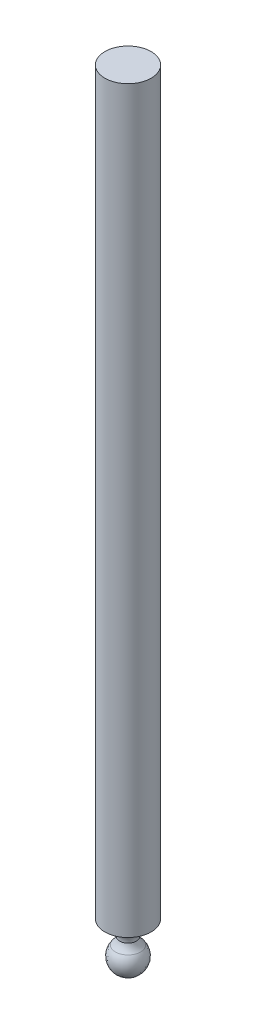
ISO-10303-21;
HEADER;
FILE_DESCRIPTION(('STEP AP214'),'2;1');
FILE_NAME('part.step','',(''),(''),'','','');
FILE_SCHEMA(('AUTOMOTIVE_DESIGN { 1 0 10303 214 1 1 1 1 }'));
ENDSEC;
DATA;
#1=APPLICATION_CONTEXT('core data for automotive mechanical design processes');
#2=APPLICATION_PROTOCOL_DEFINITION('international standard','automotive_design',2000,#1);
#3=PRODUCT_CONTEXT('',#1,'mechanical');
#4=PRODUCT('Part','Part','',(#3));
#5=PRODUCT_RELATED_PRODUCT_CATEGORY('part','',(#4));
#6=PRODUCT_DEFINITION_FORMATION('','',#4);
#7=PRODUCT_DEFINITION_CONTEXT('part definition',#1,'design');
#8=PRODUCT_DEFINITION('design','',#6,#7);
#9=PRODUCT_DEFINITION_SHAPE('','',#8);
#10=(LENGTH_UNIT() NAMED_UNIT(*) SI_UNIT(.MILLI.,.METRE.));
#11=(NAMED_UNIT(*) PLANE_ANGLE_UNIT() SI_UNIT($,.RADIAN.));
#12=(NAMED_UNIT(*) SI_UNIT($,.STERADIAN.) SOLID_ANGLE_UNIT());
#13=UNCERTAINTY_MEASURE_WITH_UNIT(LENGTH_MEASURE(1.E-05),#10,'distance_accuracy_value','');
#14=(GEOMETRIC_REPRESENTATION_CONTEXT(3) GLOBAL_UNCERTAINTY_ASSIGNED_CONTEXT((#13)) GLOBAL_UNIT_ASSIGNED_CONTEXT((#10,
#11,#12)) REPRESENTATION_CONTEXT('',''));
#15=CARTESIAN_POINT('',(0.,0.,0.));
#16=DIRECTION('',(0.,0.,1.));
#17=DIRECTION('',(1.,0.,0.));
#18=AXIS2_PLACEMENT_3D('',#15,#16,#17);
#19=CARTESIAN_POINT('',(0.,-10.4492978523732,0.155031718212298));
#20=DIRECTION('',(-1.,0.,0.));
#21=DIRECTION('',(0.,0.,1.));
#22=AXIS2_PLACEMENT_3D('',#19,#20,#21);
#23=CIRCLE('',#22,5.);
#24=TRIMMED_CURVE('',#23,(PARAMETER_VALUE(-1.60180764080338)),
(PARAMETER_VALUE(1.60180764080338)),.T.,.PARAMETER.);
#25=CARTESIAN_POINT('',(0.,-10.4492978523732,0.));
#26=DIRECTION('',(0.,1.,0.));
#27=AXIS1_PLACEMENT('',#25,#26);
#28=SURFACE_OF_REVOLUTION('',#24,#27);
#29=CARTESIAN_POINT('',(0.,-15.4468937910569,0.));
#30=VERTEX_POINT('',#29);
#31=VERTEX_LOOP('',#30);
#32=FACE_BOUND('',#31,.T.);
#33=CARTESIAN_POINT('',(0.,-7.32791100208723,0.));
#34=DIRECTION('',(0.,1.,0.));
#35=DIRECTION('',(0.,0.,1.));
#36=AXIS2_PLACEMENT_3D('',#33,#34,#35);
#37=CIRCLE('',#36,4.06104555982397);
#38=CARTESIAN_POINT('',(0.,-7.32791100208723,4.06104555982397));
#39=VERTEX_POINT('',#38);
#40=EDGE_CURVE('E11',#39,#39,#37,.T.);
#41=ORIENTED_EDGE('',*,*,#40,.F.);
#42=EDGE_LOOP('',(#41));
#43=FACE_BOUND('',#42,.T.);
#44=ADVANCED_FACE('F34',(#32,#43),#28,.T.);
#45=CARTESIAN_POINT('',(0.,-3.69137278801575,0.));
#46=DIRECTION('',(0.,1.,0.));
#47=DIRECTION('',(0.,0.,1.));
#48=AXIS2_PLACEMENT_3D('',#45,#46,#47);
#49=TOROIDAL_SURFACE('',#48,7.58438820420573,5.06343298288041);
#50=ORIENTED_EDGE('',*,*,#40,.T.);
#51=EDGE_LOOP('',(#50));
#52=FACE_BOUND('',#51,.T.);
#53=CARTESIAN_POINT('',(0.,-4.98636052247416,0.));
#54=DIRECTION('',(0.,1.,0.));
#55=DIRECTION('',(0.,0.,1.));
#56=AXIS2_PLACEMENT_3D('',#53,#54,#55);
#57=CIRCLE('',#56,2.6893539510341);
#58=CARTESIAN_POINT('',(0.,-4.98636052247416,2.6893539510341));
#59=VERTEX_POINT('',#58);
#60=EDGE_CURVE('E40',#59,#59,#57,.T.);
#61=ORIENTED_EDGE('',*,*,#60,.F.);
#62=EDGE_LOOP('',(#61));
#63=FACE_BOUND('',#62,.T.);
#64=ADVANCED_FACE('F45',(#52,#63),#49,.F.);
#65=CARTESIAN_POINT('',(0.,-5.03919739763572,0.));
#66=DIRECTION('',(0.,1.,0.));
#67=DIRECTION('',(0.,0.,1.));
#68=AXIS2_PLACEMENT_3D('',#65,#66,#67);
#69=TOROIDAL_SURFACE('',#68,7.73369036566449,5.04461312682578);
#70=ORIENTED_EDGE('',*,*,#60,.T.);
#71=EDGE_LOOP('',(#70));
#72=FACE_BOUND('',#71,.T.);
#73=CARTESIAN_POINT('',(0.,0.,0.));
#74=DIRECTION('',(0.,1.,0.));
#75=DIRECTION('',(0.,0.,1.));
#76=AXIS2_PLACEMENT_3D('',#73,#74,#75);
#77=CIRCLE('',#76,7.5);
#78=CARTESIAN_POINT('',(0.,0.,7.5));
#79=VERTEX_POINT('',#78);
#80=EDGE_CURVE('E54',#79,#79,#77,.T.);
#81=ORIENTED_EDGE('',*,*,#80,.F.);
#82=EDGE_LOOP('',(#81));
#83=FACE_BOUND('',#82,.T.);
#84=ADVANCED_FACE('F50',(#72,#83),#69,.F.);
#85=CARTESIAN_POINT('',(0.,240.,0.));
#86=DIRECTION('',(0.,-1.,0.));
#87=DIRECTION('',(0.,0.,-1.));
#88=AXIS2_PLACEMENT_3D('',#85,#86,#87);
#89=CYLINDRICAL_SURFACE('',#88,7.5);
#90=CARTESIAN_POINT('',(0.,240.,0.));
#91=DIRECTION('',(0.,1.,0.));
#92=DIRECTION('',(0.,0.,1.));
#93=AXIS2_PLACEMENT_3D('',#90,#91,#92);
#94=CIRCLE('',#93,7.5);
#95=CARTESIAN_POINT('',(0.,240.,7.5));
#96=VERTEX_POINT('',#95);
#97=EDGE_CURVE('E56',#96,#96,#94,.T.);
#98=ORIENTED_EDGE('',*,*,#97,.F.);
#99=EDGE_LOOP('',(#98));
#100=FACE_BOUND('',#99,.T.);
#101=ORIENTED_EDGE('',*,*,#80,.T.);
#102=EDGE_LOOP('',(#101));
#103=FACE_BOUND('',#102,.T.);
#104=ADVANCED_FACE('F64',(#100,#103),#89,.T.);
#105=CARTESIAN_POINT('',(0.,240.,0.));
#106=DIRECTION('',(0.,1.,0.));
#107=DIRECTION('',(0.,0.,1.));
#108=AXIS2_PLACEMENT_3D('',#105,#106,#107);
#109=PLANE('',#108);
#110=ORIENTED_EDGE('',*,*,#97,.T.);
#111=EDGE_LOOP('',(#110));
#112=FACE_BOUND('',#111,.T.);
#113=ADVANCED_FACE('F62',(#112),#109,.T.);
#114=CLOSED_SHELL('',(#44,#64,#84,#104,#113));
#115=MANIFOLD_SOLID_BREP('B2',#114);
#116=ADVANCED_BREP_SHAPE_REPRESENTATION('',(#18,#115),#14);
#117=SHAPE_DEFINITION_REPRESENTATION(#9,#116);
ENDSEC;
END-ISO-10303-21;
